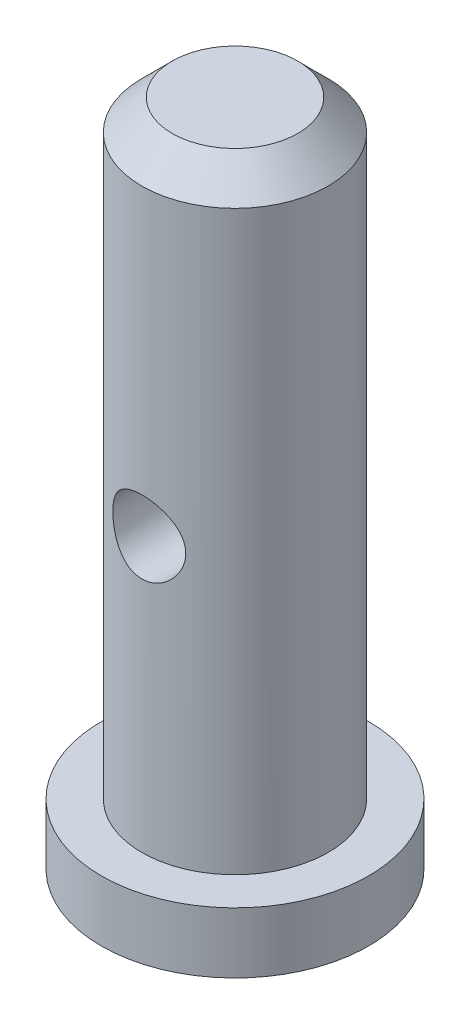
ISO-10303-21;
HEADER;
FILE_DESCRIPTION(('STEP AP214'),'2;1');
FILE_NAME('part.step','',(''),(''),'','','');
FILE_SCHEMA(('AUTOMOTIVE_DESIGN { 1 0 10303 214 1 1 1 1 }'));
ENDSEC;
DATA;
#1=APPLICATION_CONTEXT('core data for automotive mechanical design processes');
#2=APPLICATION_PROTOCOL_DEFINITION('international standard','automotive_design',2000,#1);
#3=PRODUCT_CONTEXT('',#1,'mechanical');
#4=PRODUCT('Part','Part','',(#3));
#5=PRODUCT_RELATED_PRODUCT_CATEGORY('part','',(#4));
#6=PRODUCT_DEFINITION_FORMATION('','',#4);
#7=PRODUCT_DEFINITION_CONTEXT('part definition',#1,'design');
#8=PRODUCT_DEFINITION('design','',#6,#7);
#9=PRODUCT_DEFINITION_SHAPE('','',#8);
#10=(LENGTH_UNIT() NAMED_UNIT(*) SI_UNIT(.MILLI.,.METRE.));
#11=(NAMED_UNIT(*) PLANE_ANGLE_UNIT() SI_UNIT($,.RADIAN.));
#12=(NAMED_UNIT(*) SI_UNIT($,.STERADIAN.) SOLID_ANGLE_UNIT());
#13=UNCERTAINTY_MEASURE_WITH_UNIT(LENGTH_MEASURE(1.E-05),#10,'distance_accuracy_value','');
#14=(GEOMETRIC_REPRESENTATION_CONTEXT(3) GLOBAL_UNCERTAINTY_ASSIGNED_CONTEXT((#13)) GLOBAL_UNIT_ASSIGNED_CONTEXT((#10,
#11,#12)) REPRESENTATION_CONTEXT('',''));
#15=CARTESIAN_POINT('',(0.,0.,0.));
#16=DIRECTION('',(0.,0.,1.));
#17=DIRECTION('',(1.,0.,0.));
#18=AXIS2_PLACEMENT_3D('',#15,#16,#17);
#19=CARTESIAN_POINT('',(0.,16.5,0.));
#20=DIRECTION('',(0.,1.,0.));
#21=DIRECTION('',(0.,0.,1.));
#22=AXIS2_PLACEMENT_3D('',#19,#20,#21);
#23=PLANE('',#22);
#24=CARTESIAN_POINT('',(0.,16.5,0.));
#25=DIRECTION('',(0.,1.,0.));
#26=DIRECTION('',(0.,0.,1.));
#27=AXIS2_PLACEMENT_3D('',#24,#25,#26);
#28=CIRCLE('',#27,1.55);
#29=CARTESIAN_POINT('',(0.,16.5,1.55));
#30=VERTEX_POINT('',#29);
#31=EDGE_CURVE('E10',#30,#30,#28,.T.);
#32=ORIENTED_EDGE('',*,*,#31,.T.);
#33=EDGE_LOOP('',(#32));
#34=FACE_BOUND('',#33,.T.);
#35=ADVANCED_FACE('F31',(#34),#23,.T.);
#36=CARTESIAN_POINT('',(0.,0.,0.));
#37=DIRECTION('',(0.,-1.,0.));
#38=DIRECTION('',(0.,0.,-1.));
#39=AXIS2_PLACEMENT_3D('',#36,#37,#38);
#40=CYLINDRICAL_SURFACE('',#39,2.3);
#41=CARTESIAN_POINT('',(0.,9.15,-2.3));
#42=CARTESIAN_POINT('',(0.0485881250680456,9.15000252022117,-2.30000194251176));
#43=CARTESIAN_POINT('',(0.0971598135016854,9.14605329605041,-2.29844731177194));
#44=CARTESIAN_POINT('',(0.192843439590062,9.13043146714951,-2.29240207740693));
#45=CARTESIAN_POINT('',(0.239955722783508,9.11876070548238,-2.28791217440841));
#46=CARTESIAN_POINT('',(0.331325972912502,9.08817726250527,-2.27647576042549));
#47=CARTESIAN_POINT('',(0.375589530120461,9.06927930344143,-2.26953424570955));
#48=CARTESIAN_POINT('',(0.460312278480191,9.02485625141528,-2.25387908585203));
#49=CARTESIAN_POINT('',(0.500770356669658,8.99932922785467,-2.24516492461882));
#50=CARTESIAN_POINT('',(0.57858019865896,8.94115896173875,-2.22641254562221));
#51=CARTESIAN_POINT('',(0.61573576106979,8.90826621515916,-2.21633461127213));
#52=CARTESIAN_POINT('',(0.684164477570806,8.83682790593117,-2.1961770738758));
#53=CARTESIAN_POINT('',(0.715435591222725,8.79828039070119,-2.18609747145928));
#54=CARTESIAN_POINT('',(0.772511367928543,8.71464513705866,-2.16660462795874));
#55=CARTESIAN_POINT('',(0.798029388745884,8.66934993909438,-2.15723750786524));
#56=CARTESIAN_POINT('',(0.840997179267727,8.57468763517616,-2.14085415102415));
#57=CARTESIAN_POINT('',(0.858450498297139,8.52532233179502,-2.13383688046838));
#58=CARTESIAN_POINT('',(0.884003240922014,8.42618657168662,-2.12337525441454));
#59=CARTESIAN_POINT('',(0.892479380119532,8.37652886636809,-2.11978767913623));
#60=CARTESIAN_POINT('',(0.901014424072777,8.27637625681066,-2.11617501808658));
#61=CARTESIAN_POINT('',(0.901077214161336,8.22588174978665,-2.11614828789661));
#62=CARTESIAN_POINT('',(0.893070105359724,8.12904557735048,-2.11953771885895));
#63=CARTESIAN_POINT('',(0.885537431428474,8.08265000803554,-2.12272645192637));
#64=CARTESIAN_POINT('',(0.863446285789131,7.9918432855639,-2.13180712560989));
#65=CARTESIAN_POINT('',(0.848886657478432,7.94743246040169,-2.13769951122622));
#66=CARTESIAN_POINT('',(0.812882226995773,7.86081247478661,-2.1516505825052));
#67=CARTESIAN_POINT('',(0.791306091411054,7.81866476760993,-2.15975006989345));
#68=CARTESIAN_POINT('',(0.741973046532438,7.7384380553905,-2.17719068185801));
#69=CARTESIAN_POINT('',(0.71421387583175,7.70036054655765,-2.18653226021627));
#70=CARTESIAN_POINT('',(0.650896708453076,7.62640249568103,-2.20624343759882));
#71=CARTESIAN_POINT('',(0.614914736872827,7.5908906545266,-2.21663806301058));
#72=CARTESIAN_POINT('',(0.537392104487142,7.5262901441838,-2.236696523884));
#73=CARTESIAN_POINT('',(0.495850433174919,7.49720264520899,-2.2463602259953));
#74=CARTESIAN_POINT('',(0.407379294686115,7.44582052484665,-2.26409170358516));
#75=CARTESIAN_POINT('',(0.360365635084834,7.42365895574156,-2.27212728503749));
#76=CARTESIAN_POINT('',(0.262883740929256,7.38768470906768,-2.28545543185203));
#77=CARTESIAN_POINT('',(0.212417196048846,7.37386798001421,-2.29074932814548));
#78=CARTESIAN_POINT('',(0.112557099358409,7.35570819281089,-2.29775807952099));
#79=CARTESIAN_POINT('',(0.0632667874465776,7.35086929320152,-2.29966001613075));
#80=CARTESIAN_POINT('',(-0.0354531294690618,7.3493456082013,-2.30025589630252));
#81=CARTESIAN_POINT('',(-0.0848826972802953,7.35265882000165,-2.29895062781003));
#82=CARTESIAN_POINT('',(-0.180267799570097,7.36697620090205,-2.29340162655106));
#83=CARTESIAN_POINT('',(-0.226281628529077,7.37764675999368,-2.28928542678491));
#84=CARTESIAN_POINT('',(-0.315826953906649,7.40592721914117,-2.27865921883896));
#85=CARTESIAN_POINT('',(-0.359358128666011,7.42353801606504,-2.27214890128111));
#86=CARTESIAN_POINT('',(-0.444180997718584,7.46577054870911,-2.25712550019079));
#87=CARTESIAN_POINT('',(-0.485365205427368,7.49058813875458,-2.24855782053366));
#88=CARTESIAN_POINT('',(-0.56312719579641,7.54631115179532,-2.23035540553493));
#89=CARTESIAN_POINT('',(-0.599703170156874,7.57721895250519,-2.22072025408063));
#90=CARTESIAN_POINT('',(-0.669633375013028,7.64653900160249,-2.20068108509462));
#91=CARTESIAN_POINT('',(-0.702637823962819,7.68530211189367,-2.19026696457684));
#92=CARTESIAN_POINT('',(-0.76175340825422,7.76800867013669,-2.17041627548761));
#93=CARTESIAN_POINT('',(-0.787863604559465,7.81195282259801,-2.16097984018868));
#94=CARTESIAN_POINT('',(-0.832561849046099,7.90432434707062,-2.14415911543418));
#95=CARTESIAN_POINT('',(-0.851091297568378,7.95278321633387,-2.13679094604496));
#96=CARTESIAN_POINT('',(-0.879591166592074,8.05250655145027,-2.12522010529513));
#97=CARTESIAN_POINT('',(-0.889567536571715,8.10376904067244,-2.12101523381033));
#98=CARTESIAN_POINT('',(-0.900122343852777,8.20381735516349,-2.11655605319068));
#99=CARTESIAN_POINT('',(-0.901304053908104,8.25252867909499,-2.1160482028309));
#100=CARTESIAN_POINT('',(-0.895806579965025,8.34941919872837,-2.11838131832513));
#101=CARTESIAN_POINT('',(-0.889128289289358,8.39759845427396,-2.12122190361514));
#102=CARTESIAN_POINT('',(-0.868585236784401,8.49027532180054,-2.12971253144669));
#103=CARTESIAN_POINT('',(-0.854989437032191,8.53484307477349,-2.13525712550614));
#104=CARTESIAN_POINT('',(-0.821243687027556,8.62108566718714,-2.14846117915739));
#105=CARTESIAN_POINT('',(-0.801092015275909,8.66275974328881,-2.15612119415533));
#106=CARTESIAN_POINT('',(-0.753509239195329,8.74455580934184,-2.17322247309733));
#107=CARTESIAN_POINT('',(-0.725735586367744,8.78446254095415,-2.18273911456161));
#108=CARTESIAN_POINT('',(-0.664208140501411,8.85924040876836,-2.20224166482718));
#109=CARTESIAN_POINT('',(-0.630452364198953,8.89410986797402,-2.2122277284476));
#110=CARTESIAN_POINT('',(-0.555462664506784,8.96000019448982,-2.23227566690647));
#111=CARTESIAN_POINT('',(-0.513898197852027,8.99065659295914,-2.24230501436407));
#112=CARTESIAN_POINT('',(-0.425852217780965,9.04455321566495,-2.2606794577589));
#113=CARTESIAN_POINT('',(-0.379369558208,9.06779170610964,-2.26902415977573));
#114=CARTESIAN_POINT('',(-0.278801252845679,9.10756745029833,-2.28364820855545));
#115=CARTESIAN_POINT('',(-0.224404741456332,9.12340993204762,-2.28970567387125));
#116=CARTESIAN_POINT('',(-0.11333040202314,9.14462145308468,-2.29787920108104));
#117=CARTESIAN_POINT('',(-0.0566540276411045,9.14999706140792,-2.29999773502034));
#118=CARTESIAN_POINT('',(0.,9.15,-2.3));
#119=B_SPLINE_CURVE_WITH_KNOTS('',3,(#41,#42,#43,#44,#45,#46,#47,#48,#49,#50,#51,#52,#53,#54,
#55,#56,#57,#58,#59,#60,#61,#62,#63,#64,#65,#66,#67,#68,#69,#70,#71,#72,#73,#74,#75,#76,#77,#78,
#79,#80,#81,#82,#83,#84,#85,#86,#87,#88,#89,#90,#91,#92,#93,#94,#95,#96,#97,#98,#99,#100,#101,
#102,#103,#104,#105,#106,#107,#108,#109,#110,#111,#112,#113,#114,#115,#116,#117,#118),
.UNSPECIFIED.,.T.,.F.,(4,2,2,2,2,2,2,2,2,2,2,2,2,2,2,2,2,2,2,2,2,2,2,2,2,2,2,2,2,2,2,2,2,2,2,2,
2,2,4),(0.,0.145555238294979,0.291075746364549,0.436301385719991,0.581569367010306,
0.732812145458065,0.884107271234501,1.0417920748113,1.19940741408081,1.35010916649668,
1.50074132373967,1.64141801992973,1.78211787872231,1.92561954378037,2.06917378011774,
2.22330721391677,2.37746870047924,2.53443174293764,2.69131851723093,2.83924818822498,
2.98714151952151,3.12873528968105,3.27034736362062,3.41624054496449,3.56219079857573,
3.7173664869949,3.87256330033408,4.02893810444729,4.18520404657856,4.33064256353148,
4.47606455237026,4.61622112152061,4.75641452397676,4.90440568818717,5.05244600826421,
5.20951597439533,5.36662262574193,5.53644747073832,5.70616569884699),.UNSPECIFIED.);
#120=CARTESIAN_POINT('',(0.,9.15,-2.3));
#121=VERTEX_POINT('',#120);
#122=EDGE_CURVE('E35',#121,#121,#119,.T.);
#123=ORIENTED_EDGE('',*,*,#122,.F.);
#124=EDGE_LOOP('',(#123));
#125=FACE_BOUND('',#124,.T.);
#126=CARTESIAN_POINT('',(0.9,8.25,2.11660104885167));
#127=CARTESIAN_POINT('',(0.899994933839824,8.29830847638316,2.11660563507098));
#128=CARTESIAN_POINT('',(0.896087290758335,8.34669058469506,2.11827821955683));
#129=CARTESIAN_POINT('',(0.880599460837477,8.44207270656787,2.12476127616035));
#130=CARTESIAN_POINT('',(0.868999162093892,8.48906875908856,2.12957997305482));
#131=CARTESIAN_POINT('',(0.838631307216007,8.58013965445141,2.14171938412951));
#132=CARTESIAN_POINT('',(0.819890025640549,8.62422451921292,2.14903091591048));
#133=CARTESIAN_POINT('',(0.775848569088239,8.70861300176526,2.16531936431093));
#134=CARTESIAN_POINT('',(0.750550035872033,8.74891756260817,2.17429586390719));
#135=CARTESIAN_POINT('',(0.692631319135433,8.82683010525583,2.19345293408359));
#136=CARTESIAN_POINT('',(0.659710317769664,8.86420531678639,2.2036711365976));
#137=CARTESIAN_POINT('',(0.58811495256088,8.93307341013643,2.22384872151337));
#138=CARTESIAN_POINT('',(0.549438630587493,8.9645642816717,2.23380801446642));
#139=CARTESIAN_POINT('',(0.465648501963802,9.02190855134156,2.25279430643642));
#140=CARTESIAN_POINT('',(0.420347778446239,9.04750648678664,2.26177238674133));
#141=CARTESIAN_POINT('',(0.325669384922618,9.09062000226162,2.27733087228901));
#142=CARTESIAN_POINT('',(0.276293315463781,9.10813873766844,2.28391221338013));
#143=CARTESIAN_POINT('',(0.177304269222965,9.13377261844361,2.29366955734503));
#144=CARTESIAN_POINT('',(0.12780932403246,9.14228755630284,2.29698982361226));
#145=CARTESIAN_POINT('',(0.0279891644360209,9.15095722131968,2.300371031637));
#146=CARTESIAN_POINT('',(-0.0223357477034002,9.15111492766655,2.30043313486571));
#147=CARTESIAN_POINT('',(-0.119505948629012,9.14328970373256,2.29738023106917));
#148=CARTESIAN_POINT('',(-0.16639278919154,9.13574423923999,2.29443595565324));
#149=CARTESIAN_POINT('',(-0.258173362853704,9.11346803565403,2.28592904977027));
#150=CARTESIAN_POINT('',(-0.303066950008731,9.0987367713649,2.28036622791993));
#151=CARTESIAN_POINT('',(-0.390385487122334,9.06232440601722,2.26706427746624));
#152=CARTESIAN_POINT('',(-0.432763604253932,9.04054288042769,2.25929391290624));
#153=CARTESIAN_POINT('',(-0.513371364940191,8.99074044451294,2.24235341022955));
#154=CARTESIAN_POINT('',(-0.551599607772046,8.96271743715646,2.23318280198131));
#155=CARTESIAN_POINT('',(-0.625384366735345,8.89916272118719,2.21369410948638));
#156=CARTESIAN_POINT('',(-0.660619695452499,8.8632685828844,2.20334013382927));
#157=CARTESIAN_POINT('',(-0.724698727879983,8.78603245098875,2.18310408306874));
#158=CARTESIAN_POINT('',(-0.753540518505145,8.7446888326784,2.17322214990272));
#159=CARTESIAN_POINT('',(-0.8047046159645,8.6563515326678,2.15481120466712));
#160=CARTESIAN_POINT('',(-0.826837717881241,8.60923880978226,2.14632409559226));
#161=CARTESIAN_POINT('',(-0.862730415244558,8.51153452100518,2.13215221352453));
#162=CARTESIAN_POINT('',(-0.876495171794926,8.46094512079868,2.12646571369225));
#163=CARTESIAN_POINT('',(-0.894497123657244,8.3609179226223,2.11895376488821));
#164=CARTESIAN_POINT('',(-0.899248991840736,8.31158856358854,2.11692012219345));
#165=CARTESIAN_POINT('',(-0.900585694345764,8.21280617594829,2.11635226472516));
#166=CARTESIAN_POINT('',(-0.897172843006751,8.16335318635508,2.11781705829837));
#167=CARTESIAN_POINT('',(-0.88274494878798,8.06850628490017,2.12386812855535));
#168=CARTESIAN_POINT('',(-0.872146459641483,8.02303676972916,2.1282831852869));
#169=CARTESIAN_POINT('',(-0.844182732486689,7.93454816342772,2.13952821004143));
#170=CARTESIAN_POINT('',(-0.826816034428562,7.8915296033182,2.14635869909621));
#171=CARTESIAN_POINT('',(-0.785040201029857,7.80726952003412,2.16199598213374));
#172=CARTESIAN_POINT('',(-0.760379810913362,7.76616546921064,2.17087022720022));
#173=CARTESIAN_POINT('',(-0.704977097683321,7.68849767993693,2.18948860316323));
#174=CARTESIAN_POINT('',(-0.674232383250496,7.65193573589518,2.19923307525575));
#175=CARTESIAN_POINT('',(-0.604986968237141,7.5817274756001,2.21931911761936));
#176=CARTESIAN_POINT('',(-0.566093622245432,7.54846528207737,2.22965465320435));
#177=CARTESIAN_POINT('',(-0.483027649637726,7.48888487709469,2.24911131040256));
#178=CARTESIAN_POINT('',(-0.438854884304574,7.46256684815151,2.25823240009279));
#179=CARTESIAN_POINT('',(-0.346398444964577,7.41774885576138,2.27424785048457));
#180=CARTESIAN_POINT('',(-0.29812098006046,7.39923732776658,2.28114550139029));
#181=CARTESIAN_POINT('',(-0.198802512977826,7.3707143938836,2.29193519420241));
#182=CARTESIAN_POINT('',(-0.147762953296196,7.36069859583581,2.29582878906456));
#183=CARTESIAN_POINT('',(-0.0478258735851777,7.34995641988487,2.30001229120278));
#184=CARTESIAN_POINT('',(0.00100481487451614,7.34868605460068,2.30051319797281));
#185=CARTESIAN_POINT('',(0.0981574643966298,7.35404745358287,2.29841785638141));
#186=CARTESIAN_POINT('',(0.14647949587848,7.36067810910708,2.29582204257956));
#187=CARTESIAN_POINT('',(0.239840066357824,7.38126643148965,2.28792738714358));
#188=CARTESIAN_POINT('',(0.284932888043679,7.39501057561921,2.28270743758751));
#189=CARTESIAN_POINT('',(0.372168686287691,7.42921571606682,2.27011778659435));
#190=CARTESIAN_POINT('',(0.414311106119199,7.44967797593871,2.26274768078153));
#191=CARTESIAN_POINT('',(0.496463662278659,7.49774562794506,2.24618707148564));
#192=CARTESIAN_POINT('',(0.536301108070001,7.52562320432251,2.23693128771691));
#193=CARTESIAN_POINT('',(0.610896090946625,7.58731566228717,2.21772230023152));
#194=CARTESIAN_POINT('',(0.645651647627738,7.62113284729008,2.20776882684984));
#195=CARTESIAN_POINT('',(0.711201939363596,7.69609229531541,2.18756418380549));
#196=CARTESIAN_POINT('',(0.74164470512859,7.73754789673696,2.17732980479297));
#197=CARTESIAN_POINT('',(0.795160479845728,7.82531293390222,2.15836273798012));
#198=CARTESIAN_POINT('',(0.818232485572119,7.87162302924724,2.14963025467571));
#199=CARTESIAN_POINT('',(0.854542910775184,7.96366468034556,2.13543981479917));
#200=CARTESIAN_POINT('',(0.868463972925449,8.00909378824744,2.12976254210596));
#201=CARTESIAN_POINT('',(0.888966853314737,8.10175720309406,2.12128872343166));
#202=CARTESIAN_POINT('',(0.895569408862562,8.14898601511619,2.11848403956919));
#203=CARTESIAN_POINT('',(0.899469201617517,8.21425226066598,2.11682612515721));
#204=CARTESIAN_POINT('',(0.90000187498015,8.23212108753354,2.11659935149709));
#205=CARTESIAN_POINT('',(0.9,8.25,2.11660104885167));
#206=B_SPLINE_CURVE_WITH_KNOTS('',3,(#126,#127,#128,#129,#130,#131,#132,#133,#134,#135,#136,
#137,#138,#139,#140,#141,#142,#143,#144,#145,#146,#147,#148,#149,#150,#151,#152,#153,#154,#155,
#156,#157,#158,#159,#160,#161,#162,#163,#164,#165,#166,#167,#168,#169,#170,#171,#172,#173,#174,
#175,#176,#177,#178,#179,#180,#181,#182,#183,#184,#185,#186,#187,#188,#189,#190,#191,#192,#193,
#194,#195,#196,#197,#198,#199,#200,#201,#202,#203,#204,#205),.UNSPECIFIED.,.T.,.F.,(4,2,2,2,2,2,
2,2,2,2,2,2,2,2,2,2,2,2,2,2,2,2,2,2,2,2,2,2,2,2,2,2,2,2,2,2,2,2,2,4),(0.,0.144871687430834,
0.290123632805205,0.434846219288186,0.579532606044199,0.731392504192748,0.883304188205591,
1.04090825658713,1.19845071957864,1.34865924108399,1.49881421583461,1.64089166605242,
1.78297950198317,1.92718755556971,2.07144413388466,2.22481083447252,2.37822336394247,
2.53562846958268,2.69293639825838,2.84095396501137,2.98892958025547,3.12898723617677,
3.26907512231873,3.41470080109367,3.56038382914314,3.71628053205842,3.87218133207259,
4.02785036242438,4.18343886518461,4.32925423051577,4.4750491361354,4.61670180885668,
4.7583811391137,4.90622821539072,5.05413275475546,5.21071399585371,5.36731653997529,
5.51024743811496,5.65277229166868,5.70638913931876),.UNSPECIFIED.);
#207=CARTESIAN_POINT('',(0.9,8.25,2.11660104885167));
#208=VERTEX_POINT('',#207);
#209=EDGE_CURVE('E51',#208,#208,#206,.T.);
#210=ORIENTED_EDGE('',*,*,#209,.F.);
#211=EDGE_LOOP('',(#210));
#212=FACE_BOUND('',#211,.T.);
#213=CARTESIAN_POINT('',(0.,15.75,0.));
#214=DIRECTION('',(0.,1.,0.));
#215=DIRECTION('',(0.,0.,1.));
#216=AXIS2_PLACEMENT_3D('',#213,#214,#215);
#217=CIRCLE('',#216,2.3);
#218=CARTESIAN_POINT('',(0.,15.75,2.3));
#219=VERTEX_POINT('',#218);
#220=EDGE_CURVE('E43',#219,#219,#217,.F.);
#221=ORIENTED_EDGE('',*,*,#220,.T.);
#222=EDGE_LOOP('',(#221));
#223=FACE_BOUND('',#222,.T.);
#224=CARTESIAN_POINT('',(0.,1.5,0.));
#225=DIRECTION('',(0.,-1.,0.));
#226=DIRECTION('',(0.,0.,-1.));
#227=AXIS2_PLACEMENT_3D('',#224,#225,#226);
#228=CIRCLE('',#227,2.3);
#229=CARTESIAN_POINT('',(0.,1.5,-2.3));
#230=VERTEX_POINT('',#229);
#231=EDGE_CURVE('E48',#230,#230,#228,.T.);
#232=ORIENTED_EDGE('',*,*,#231,.F.);
#233=EDGE_LOOP('',(#232));
#234=FACE_BOUND('',#233,.T.);
#235=ADVANCED_FACE('F55',(#125,#212,#223,#234),#40,.T.);
#236=CARTESIAN_POINT('',(2.3,1.5,0.));
#237=DIRECTION('',(0.,1.,0.));
#238=DIRECTION('',(0.,0.,1.));
#239=AXIS2_PLACEMENT_3D('',#236,#237,#238);
#240=PLANE('',#239);
#241=ORIENTED_EDGE('',*,*,#231,.T.);
#242=EDGE_LOOP('',(#241));
#243=FACE_BOUND('',#242,.T.);
#244=CARTESIAN_POINT('',(0.,1.5,0.));
#245=DIRECTION('',(0.,-1.,0.));
#246=DIRECTION('',(0.,0.,-1.));
#247=AXIS2_PLACEMENT_3D('',#244,#245,#246);
#248=CIRCLE('',#247,3.3);
#249=CARTESIAN_POINT('',(0.,1.5,-3.3));
#250=VERTEX_POINT('',#249);
#251=EDGE_CURVE('E126',#250,#250,#248,.T.);
#252=ORIENTED_EDGE('',*,*,#251,.F.);
#253=EDGE_LOOP('',(#252));
#254=FACE_BOUND('',#253,.T.);
#255=ADVANCED_FACE('F70',(#243,#254),#240,.T.);
#256=CARTESIAN_POINT('',(0.,0.,0.));
#257=DIRECTION('',(0.,-1.,0.));
#258=DIRECTION('',(0.,0.,-1.));
#259=AXIS2_PLACEMENT_3D('',#256,#257,#258);
#260=CYLINDRICAL_SURFACE('',#259,3.3);
#261=ORIENTED_EDGE('',*,*,#251,.T.);
#262=EDGE_LOOP('',(#261));
#263=FACE_BOUND('',#262,.T.);
#264=CARTESIAN_POINT('',(0.,0.,0.));
#265=DIRECTION('',(0.,-1.,0.));
#266=DIRECTION('',(0.,0.,-1.));
#267=AXIS2_PLACEMENT_3D('',#264,#265,#266);
#268=CIRCLE('',#267,3.3);
#269=CARTESIAN_POINT('',(0.,0.,-3.3));
#270=VERTEX_POINT('',#269);
#271=EDGE_CURVE('E128',#270,#270,#268,.T.);
#272=ORIENTED_EDGE('',*,*,#271,.F.);
#273=EDGE_LOOP('',(#272));
#274=FACE_BOUND('',#273,.T.);
#275=ADVANCED_FACE('F67',(#263,#274),#260,.T.);
#276=CARTESIAN_POINT('',(3.3,0.,0.));
#277=DIRECTION('',(0.,-1.,0.));
#278=DIRECTION('',(0.,0.,-1.));
#279=AXIS2_PLACEMENT_3D('',#276,#277,#278);
#280=PLANE('',#279);
#281=ORIENTED_EDGE('',*,*,#271,.T.);
#282=EDGE_LOOP('',(#281));
#283=FACE_BOUND('',#282,.T.);
#284=ADVANCED_FACE('F63',(#283),#280,.T.);
#285=CARTESIAN_POINT('',(0.,15.75,0.));
#286=DIRECTION('',(0.,-1.,0.));
#287=DIRECTION('',(0.,0.,-1.));
#288=AXIS2_PLACEMENT_3D('',#285,#286,#287);
#289=CONICAL_SURFACE('',#288,2.3,0.78539816339745);
#290=ORIENTED_EDGE('',*,*,#31,.F.);
#291=EDGE_LOOP('',(#290));
#292=FACE_BOUND('',#291,.T.);
#293=ORIENTED_EDGE('',*,*,#220,.F.);
#294=EDGE_LOOP('',(#293));
#295=FACE_BOUND('',#294,.T.);
#296=ADVANCED_FACE('F33',(#292,#295),#289,.T.);
#297=CARTESIAN_POINT('',(0.,8.25,-3.3));
#298=DIRECTION('',(0.,0.,1.));
#299=DIRECTION('',(1.,0.,0.));
#300=AXIS2_PLACEMENT_3D('',#297,#298,#299);
#301=CYLINDRICAL_SURFACE('',#300,0.9);
#302=ORIENTED_EDGE('',*,*,#122,.T.);
#303=EDGE_LOOP('',(#302));
#304=FACE_BOUND('',#303,.T.);
#305=ORIENTED_EDGE('',*,*,#209,.T.);
#306=EDGE_LOOP('',(#305));
#307=FACE_BOUND('',#306,.T.);
#308=ADVANCED_FACE('F58',(#304,#307),#301,.F.);
#309=CLOSED_SHELL('',(#35,#235,#255,#275,#284,#296,#308));
#310=MANIFOLD_SOLID_BREP('B2',#309);
#311=ADVANCED_BREP_SHAPE_REPRESENTATION('',(#18,#310),#14);
#312=SHAPE_DEFINITION_REPRESENTATION(#9,#311);
ENDSEC;
END-ISO-10303-21;
